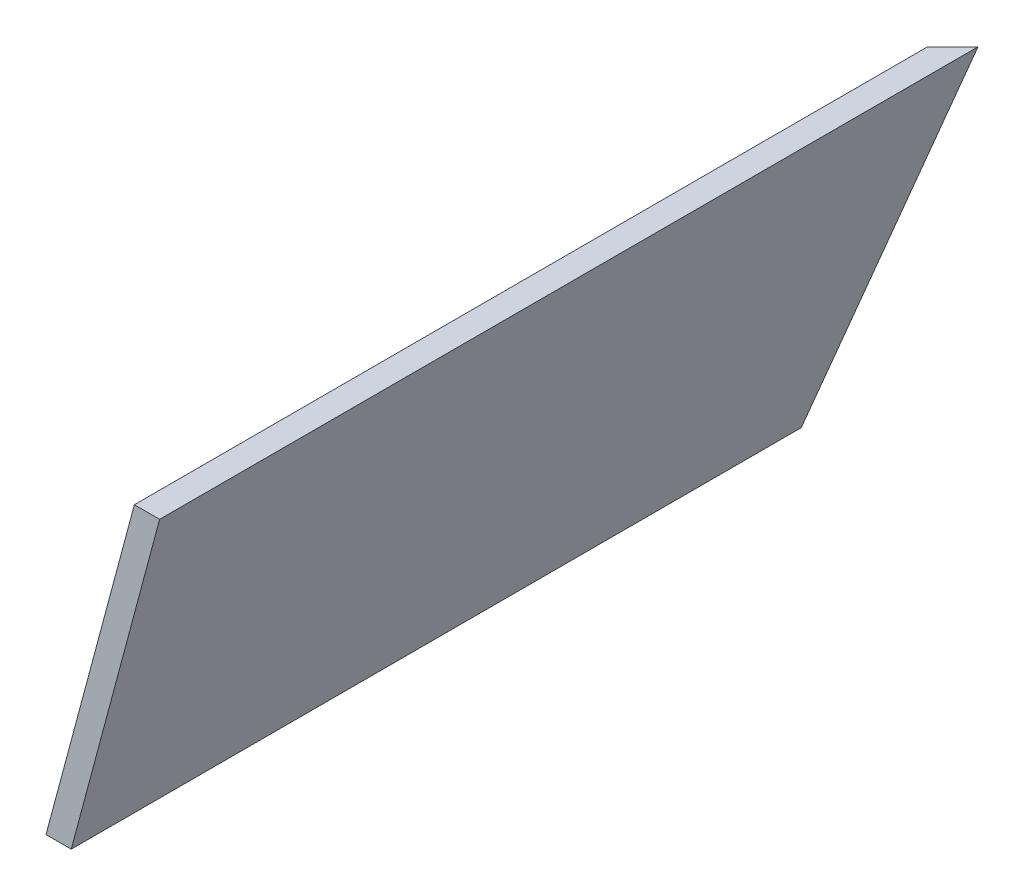
ISO-10303-21;
HEADER;
FILE_DESCRIPTION(('STEP AP214'),'2;1');
FILE_NAME('part.step','',(''),(''),'','','');
FILE_SCHEMA(('AUTOMOTIVE_DESIGN { 1 0 10303 214 1 1 1 1 }'));
ENDSEC;
DATA;
#1=APPLICATION_CONTEXT('core data for automotive mechanical design processes');
#2=APPLICATION_PROTOCOL_DEFINITION('international standard','automotive_design',2000,#1);
#3=PRODUCT_CONTEXT('',#1,'mechanical');
#4=PRODUCT('Part','Part','',(#3));
#5=PRODUCT_RELATED_PRODUCT_CATEGORY('part','',(#4));
#6=PRODUCT_DEFINITION_FORMATION('','',#4);
#7=PRODUCT_DEFINITION_CONTEXT('part definition',#1,'design');
#8=PRODUCT_DEFINITION('design','',#6,#7);
#9=PRODUCT_DEFINITION_SHAPE('','',#8);
#10=(LENGTH_UNIT() NAMED_UNIT(*) SI_UNIT(.MILLI.,.METRE.));
#11=(NAMED_UNIT(*) PLANE_ANGLE_UNIT() SI_UNIT($,.RADIAN.));
#12=(NAMED_UNIT(*) SI_UNIT($,.STERADIAN.) SOLID_ANGLE_UNIT());
#13=UNCERTAINTY_MEASURE_WITH_UNIT(LENGTH_MEASURE(1.E-05),#10,'distance_accuracy_value','');
#14=(GEOMETRIC_REPRESENTATION_CONTEXT(3) GLOBAL_UNCERTAINTY_ASSIGNED_CONTEXT((#13)) GLOBAL_UNIT_ASSIGNED_CONTEXT((#10,
#11,#12)) REPRESENTATION_CONTEXT('',''));
#15=CARTESIAN_POINT('',(0.,0.,0.));
#16=DIRECTION('',(0.,0.,1.));
#17=DIRECTION('',(1.,0.,0.));
#18=AXIS2_PLACEMENT_3D('',#15,#16,#17);
#19=CARTESIAN_POINT('',(412.955618728019,171.741611914197,-615.788493715292));
#20=DIRECTION('',(-0.96592582628907,0.258819045102514,0.));
#21=DIRECTION('',(-0.258819045102514,-0.96592582628907,0.));
#22=AXIS2_PLACEMENT_3D('',#19,#20,#21);
#23=PLANE('',#22);
#24=DIRECTION('',(0.250562807085726,0.935113126531033,-0.250562807085726));
#25=VECTOR('',#24,1.);
#26=CARTESIAN_POINT('',(425.689815552035,219.26628145501,-425.689815552035));
#27=LINE('',#26,#25);
#28=CARTESIAN_POINT('',(366.937592508792,0.,-366.937592508792));
#29=VERTEX_POINT('',#28);
#30=CARTESIAN_POINT('',(412.955618728019,171.741611914197,-412.955618728019));
#31=VERTEX_POINT('',#30);
#32=EDGE_CURVE('E48',#29,#31,#27,.T.);
#33=ORIENTED_EDGE('',*,*,#32,.F.);
#34=DIRECTION('',(0.,0.,1.));
#35=VECTOR('',#34,1.);
#36=CARTESIAN_POINT('',(366.937592508792,0.,-615.788493715292));
#37=LINE('',#36,#35);
#38=CARTESIAN_POINT('',(366.937592508792,0.,0.));
#39=VERTEX_POINT('',#38);
#40=EDGE_CURVE('E76',#29,#39,#37,.T.);
#41=ORIENTED_EDGE('',*,*,#40,.T.);
#42=DIRECTION('',(-0.258819045102514,-0.96592582628907,0.));
#43=VECTOR('',#42,1.);
#44=CARTESIAN_POINT('',(412.955618728019,171.741611914197,0.));
#45=LINE('',#44,#43);
#46=CARTESIAN_POINT('',(412.955618728019,171.741611914197,0.));
#47=VERTEX_POINT('',#46);
#48=EDGE_CURVE('E80',#47,#39,#45,.T.);
#49=ORIENTED_EDGE('',*,*,#48,.F.);
#50=DIRECTION('',(0.,0.,1.));
#51=VECTOR('',#50,1.);
#52=CARTESIAN_POINT('',(412.955618728019,171.741611914197,-615.788493715292));
#53=LINE('',#52,#51);
#54=EDGE_CURVE('E108',#31,#47,#53,.T.);
#55=ORIENTED_EDGE('',*,*,#54,.F.);
#56=EDGE_LOOP('',(#33,#41,#49,#55));
#57=FACE_BOUND('',#56,.T.);
#58=ADVANCED_FACE('F39',(#57),#23,.T.);
#59=CARTESIAN_POINT('',(426.103626219227,171.741611914197,-615.788493715292));
#60=DIRECTION('',(0.,1.,0.));
#61=DIRECTION('',(0.,0.,1.));
#62=AXIS2_PLACEMENT_3D('',#59,#60,#61);
#63=PLANE('',#62);
#64=DIRECTION('',(0.707106781186548,0.,-0.707106781186548));
#65=VECTOR('',#64,1.);
#66=CARTESIAN_POINT('',(520.94605996726,171.741611914197,-520.94605996726));
#67=LINE('',#66,#65);
#68=CARTESIAN_POINT('',(426.103626219227,171.741611914197,-426.103626219227));
#69=VERTEX_POINT('',#68);
#70=EDGE_CURVE('E54',#31,#69,#67,.T.);
#71=ORIENTED_EDGE('',*,*,#70,.F.);
#72=ORIENTED_EDGE('',*,*,#54,.T.);
#73=DIRECTION('',(-1.,0.,0.));
#74=VECTOR('',#73,1.);
#75=CARTESIAN_POINT('',(426.103626219227,171.741611914197,0.));
#76=LINE('',#75,#74);
#77=CARTESIAN_POINT('',(426.103626219227,171.741611914197,0.));
#78=VERTEX_POINT('',#77);
#79=EDGE_CURVE('E86',#78,#47,#76,.T.);
#80=ORIENTED_EDGE('',*,*,#79,.F.);
#81=DIRECTION('',(0.,0.,1.));
#82=VECTOR('',#81,1.);
#83=CARTESIAN_POINT('',(426.103626219227,171.741611914197,-615.788493715292));
#84=LINE('',#83,#82);
#85=EDGE_CURVE('E112',#69,#78,#84,.T.);
#86=ORIENTED_EDGE('',*,*,#85,.F.);
#87=EDGE_LOOP('',(#71,#72,#80,#86));
#88=FACE_BOUND('',#87,.T.);
#89=ADVANCED_FACE('F123',(#88),#63,.T.);
#90=CARTESIAN_POINT('',(380.0856,0.,-615.788493715292));
#91=DIRECTION('',(0.96592582628907,-0.258819045102514,0.));
#92=DIRECTION('',(0.258819045102514,0.96592582628907,0.));
#93=AXIS2_PLACEMENT_3D('',#90,#91,#92);
#94=PLANE('',#93);
#95=DIRECTION('',(-0.250562807085725,-0.935113126531033,0.250562807085725));
#96=VECTOR('',#95,1.);
#97=CARTESIAN_POINT('',(394.88343314588,55.2262651423517,-394.88343314588));
#98=LINE('',#97,#96);
#99=CARTESIAN_POINT('',(380.0856,0.,-380.0856));
#100=VERTEX_POINT('',#99);
#101=EDGE_CURVE('E111',#69,#100,#98,.T.);
#102=ORIENTED_EDGE('',*,*,#101,.F.);
#103=ORIENTED_EDGE('',*,*,#85,.T.);
#104=DIRECTION('',(0.258819045102514,0.96592582628907,0.));
#105=VECTOR('',#104,1.);
#106=CARTESIAN_POINT('',(380.0856,0.,0.));
#107=LINE('',#106,#105);
#108=CARTESIAN_POINT('',(380.0856,0.,0.));
#109=VERTEX_POINT('',#108);
#110=EDGE_CURVE('E95',#109,#78,#107,.T.);
#111=ORIENTED_EDGE('',*,*,#110,.F.);
#112=DIRECTION('',(0.,0.,1.));
#113=VECTOR('',#112,1.);
#114=CARTESIAN_POINT('',(380.0856,0.,-615.788493715292));
#115=LINE('',#114,#113);
#116=EDGE_CURVE('E85',#100,#109,#115,.T.);
#117=ORIENTED_EDGE('',*,*,#116,.F.);
#118=EDGE_LOOP('',(#102,#103,#111,#117));
#119=FACE_BOUND('',#118,.T.);
#120=ADVANCED_FACE('F125',(#119),#94,.T.);
#121=CARTESIAN_POINT('',(366.937592508792,0.,-615.788493715292));
#122=DIRECTION('',(0.,-1.,0.));
#123=DIRECTION('',(0.,0.,-1.));
#124=AXIS2_PLACEMENT_3D('',#121,#122,#123);
#125=PLANE('',#124);
#126=DIRECTION('',(-0.707106781186548,0.,0.707106781186548));
#127=VECTOR('',#126,1.);
#128=CARTESIAN_POINT('',(491.363043112042,0.,-491.363043112042));
#129=LINE('',#128,#127);
#130=EDGE_CURVE('E11',#100,#29,#129,.T.);
#131=ORIENTED_EDGE('',*,*,#130,.F.);
#132=ORIENTED_EDGE('',*,*,#116,.T.);
#133=DIRECTION('',(1.,0.,0.));
#134=VECTOR('',#133,1.);
#135=CARTESIAN_POINT('',(366.937592508792,0.,0.));
#136=LINE('',#135,#134);
#137=EDGE_CURVE('E88',#39,#109,#136,.T.);
#138=ORIENTED_EDGE('',*,*,#137,.F.);
#139=ORIENTED_EDGE('',*,*,#40,.F.);
#140=EDGE_LOOP('',(#131,#132,#138,#139));
#141=FACE_BOUND('',#140,.T.);
#142=ADVANCED_FACE('F89',(#141),#125,.T.);
#143=CARTESIAN_POINT('',(0.,0.,0.));
#144=DIRECTION('',(0.,0.,1.));
#145=DIRECTION('',(1.,0.,0.));
#146=AXIS2_PLACEMENT_3D('',#143,#144,#145);
#147=PLANE('',#146);
#148=ORIENTED_EDGE('',*,*,#48,.T.);
#149=ORIENTED_EDGE('',*,*,#137,.T.);
#150=ORIENTED_EDGE('',*,*,#110,.T.);
#151=ORIENTED_EDGE('',*,*,#79,.T.);
#152=EDGE_LOOP('',(#148,#149,#150,#151));
#153=FACE_BOUND('',#152,.T.);
#154=ADVANCED_FACE('F97',(#153),#147,.T.);
#155=CARTESIAN_POINT('',(0.,0.,0.));
#156=DIRECTION('',(0.707106781186548,0.,0.707106781186548));
#157=DIRECTION('',(0.707106781186548,0.,-0.707106781186548));
#158=AXIS2_PLACEMENT_3D('',#155,#156,#157);
#159=PLANE('',#158);
#160=ORIENTED_EDGE('',*,*,#32,.T.);
#161=ORIENTED_EDGE('',*,*,#70,.T.);
#162=ORIENTED_EDGE('',*,*,#101,.T.);
#163=ORIENTED_EDGE('',*,*,#130,.T.);
#164=EDGE_LOOP('',(#160,#161,#162,#163));
#165=FACE_BOUND('',#164,.T.);
#166=ADVANCED_FACE('F120',(#165),#159,.F.);
#167=CLOSED_SHELL('',(#58,#89,#120,#142,#154,#166));
#168=MANIFOLD_SOLID_BREP('B2',#167);
#169=ADVANCED_BREP_SHAPE_REPRESENTATION('',(#18,#168),#14);
#170=SHAPE_DEFINITION_REPRESENTATION(#9,#169);
ENDSEC;
END-ISO-10303-21;
